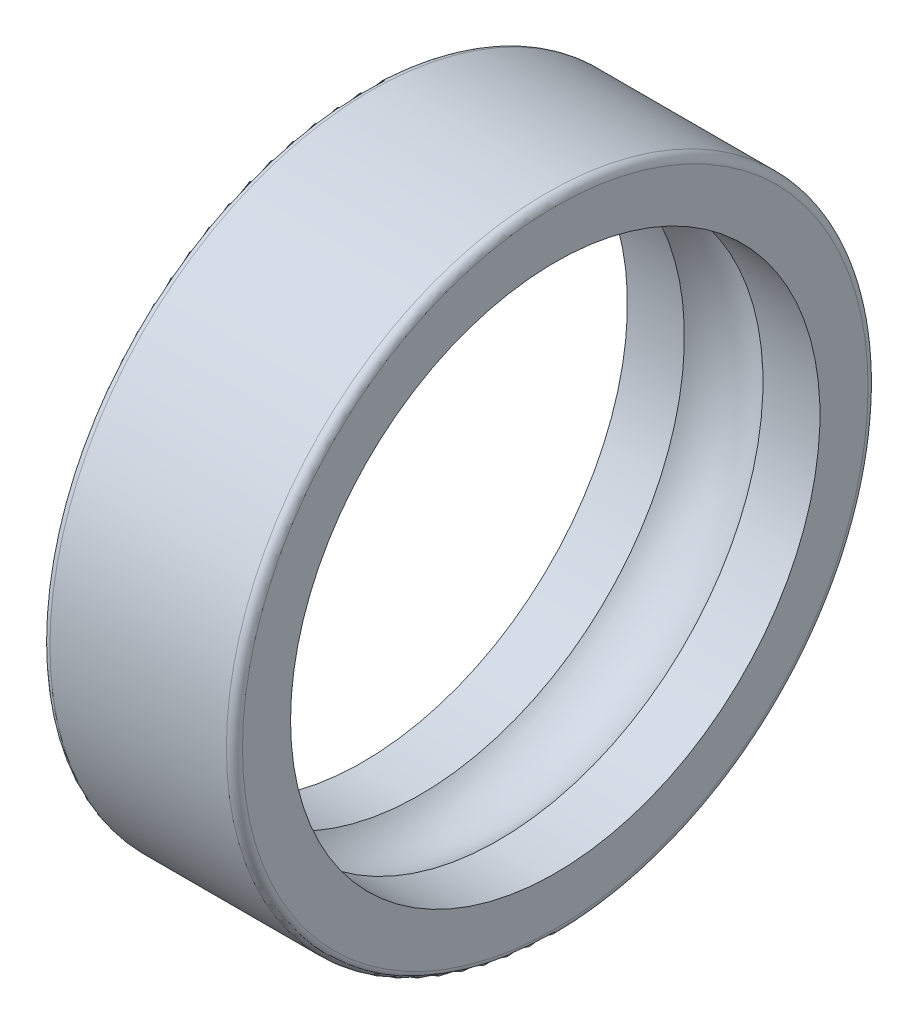
ISO-10303-21;
HEADER;
FILE_DESCRIPTION(('STEP AP214'),'2;1');
FILE_NAME('part.step','',(''),(''),'','','');
FILE_SCHEMA(('AUTOMOTIVE_DESIGN { 1 0 10303 214 1 1 1 1 }'));
ENDSEC;
DATA;
#1=APPLICATION_CONTEXT('core data for automotive mechanical design processes');
#2=APPLICATION_PROTOCOL_DEFINITION('international standard','automotive_design',2000,#1);
#3=PRODUCT_CONTEXT('',#1,'mechanical');
#4=PRODUCT('Part','Part','',(#3));
#5=PRODUCT_RELATED_PRODUCT_CATEGORY('part','',(#4));
#6=PRODUCT_DEFINITION_FORMATION('','',#4);
#7=PRODUCT_DEFINITION_CONTEXT('part definition',#1,'design');
#8=PRODUCT_DEFINITION('design','',#6,#7);
#9=PRODUCT_DEFINITION_SHAPE('','',#8);
#10=(LENGTH_UNIT() NAMED_UNIT(*) SI_UNIT(.MILLI.,.METRE.));
#11=(NAMED_UNIT(*) PLANE_ANGLE_UNIT() SI_UNIT($,.RADIAN.));
#12=(NAMED_UNIT(*) SI_UNIT($,.STERADIAN.) SOLID_ANGLE_UNIT());
#13=UNCERTAINTY_MEASURE_WITH_UNIT(LENGTH_MEASURE(1.E-05),#10,'distance_accuracy_value','');
#14=(GEOMETRIC_REPRESENTATION_CONTEXT(3) GLOBAL_UNCERTAINTY_ASSIGNED_CONTEXT((#13)) GLOBAL_UNIT_ASSIGNED_CONTEXT((#10,
#11,#12)) REPRESENTATION_CONTEXT('',''));
#15=CARTESIAN_POINT('',(0.,0.,0.));
#16=DIRECTION('',(0.,0.,1.));
#17=DIRECTION('',(1.,0.,0.));
#18=AXIS2_PLACEMENT_3D('',#15,#16,#17);
#19=CARTESIAN_POINT('',(-10.537576458291,-14.,0.));
#20=DIRECTION('',(-1.,0.,0.));
#21=DIRECTION('',(0.,0.,1.));
#22=AXIS2_PLACEMENT_3D('',#19,#20,#21);
#23=CYLINDRICAL_SURFACE('',#22,16.5);
#24=CARTESIAN_POINT('',(2.71857748410758,-14.,0.));
#25=DIRECTION('',(-1.,0.,0.));
#26=DIRECTION('',(0.,0.,1.));
#27=AXIS2_PLACEMENT_3D('',#24,#25,#26);
#28=CIRCLE('',#27,16.5);
#29=CARTESIAN_POINT('',(2.71857748410758,-14.,16.5));
#30=VERTEX_POINT('',#29);
#31=EDGE_CURVE('E63',#30,#30,#28,.T.);
#32=ORIENTED_EDGE('',*,*,#31,.F.);
#33=EDGE_LOOP('',(#32));
#34=FACE_BOUND('',#33,.T.);
#35=CARTESIAN_POINT('',(-0.831932773109246,-14.,0.));
#36=DIRECTION('',(-1.,0.,0.));
#37=DIRECTION('',(0.,0.,1.));
#38=AXIS2_PLACEMENT_3D('',#35,#36,#37);
#39=CIRCLE('',#38,16.5);
#40=CARTESIAN_POINT('',(-0.831932773109246,-14.,16.5));
#41=VERTEX_POINT('',#40);
#42=EDGE_CURVE('E10',#41,#41,#39,.T.);
#43=ORIENTED_EDGE('',*,*,#42,.T.);
#44=EDGE_LOOP('',(#43));
#45=FACE_BOUND('',#44,.T.);
#46=ADVANCED_FACE('F35',(#34,#45),#23,.F.);
#47=CARTESIAN_POINT('',(-0.831932773109246,2.5,0.));
#48=DIRECTION('',(1.,0.,0.));
#49=DIRECTION('',(0.,0.,-1.));
#50=AXIS2_PLACEMENT_3D('',#47,#48,#49);
#51=PLANE('',#50);
#52=ORIENTED_EDGE('',*,*,#42,.F.);
#53=EDGE_LOOP('',(#52));
#54=FACE_BOUND('',#53,.T.);
#55=CARTESIAN_POINT('',(-0.831932773109246,-14.,0.));
#56=DIRECTION('',(-1.,0.,0.));
#57=DIRECTION('',(0.,0.,1.));
#58=AXIS2_PLACEMENT_3D('',#55,#56,#57);
#59=CIRCLE('',#58,19.5);
#60=CARTESIAN_POINT('',(-0.831932773109246,-14.,19.5));
#61=VERTEX_POINT('',#60);
#62=EDGE_CURVE('E41',#61,#61,#59,.T.);
#63=ORIENTED_EDGE('',*,*,#62,.T.);
#64=EDGE_LOOP('',(#63));
#65=FACE_BOUND('',#64,.T.);
#66=ADVANCED_FACE('F70',(#54,#65),#51,.F.);
#67=CARTESIAN_POINT('',(-0.331932773109246,-14.,0.));
#68=DIRECTION('',(-1.,0.,0.));
#69=DIRECTION('',(0.,0.,1.));
#70=AXIS2_PLACEMENT_3D('',#67,#68,#69);
#71=TOROIDAL_SURFACE('',#70,19.5,0.5);
#72=ORIENTED_EDGE('',*,*,#62,.F.);
#73=EDGE_LOOP('',(#72));
#74=FACE_BOUND('',#73,.T.);
#75=CARTESIAN_POINT('',(-0.331932773109242,-14.,0.));
#76=DIRECTION('',(-1.,0.,0.));
#77=DIRECTION('',(0.,0.,1.));
#78=AXIS2_PLACEMENT_3D('',#75,#76,#77);
#79=CIRCLE('',#78,20.);
#80=CARTESIAN_POINT('',(-0.331932773109242,-14.,20.));
#81=VERTEX_POINT('',#80);
#82=EDGE_CURVE('E45',#81,#81,#79,.T.);
#83=ORIENTED_EDGE('',*,*,#82,.T.);
#84=EDGE_LOOP('',(#83));
#85=FACE_BOUND('',#84,.T.);
#86=ADVANCED_FACE('F74',(#74,#85),#71,.T.);
#87=CARTESIAN_POINT('',(-10.537576458291,-14.,0.));
#88=DIRECTION('',(-1.,0.,0.));
#89=DIRECTION('',(0.,0.,1.));
#90=AXIS2_PLACEMENT_3D('',#87,#88,#89);
#91=CYLINDRICAL_SURFACE('',#90,20.);
#92=ORIENTED_EDGE('',*,*,#82,.F.);
#93=EDGE_LOOP('',(#92));
#94=FACE_BOUND('',#93,.T.);
#95=CARTESIAN_POINT('',(10.6680672268908,-14.,0.));
#96=DIRECTION('',(-1.,0.,0.));
#97=DIRECTION('',(0.,0.,1.));
#98=AXIS2_PLACEMENT_3D('',#95,#96,#97);
#99=CIRCLE('',#98,20.);
#100=CARTESIAN_POINT('',(10.6680672268908,-14.,20.));
#101=VERTEX_POINT('',#100);
#102=EDGE_CURVE('E49',#101,#101,#99,.T.);
#103=ORIENTED_EDGE('',*,*,#102,.T.);
#104=EDGE_LOOP('',(#103));
#105=FACE_BOUND('',#104,.T.);
#106=ADVANCED_FACE('F79',(#94,#105),#91,.T.);
#107=CARTESIAN_POINT('',(10.6680672268908,-14.,0.));
#108=DIRECTION('',(-1.,0.,0.));
#109=DIRECTION('',(0.,0.,1.));
#110=AXIS2_PLACEMENT_3D('',#107,#108,#109);
#111=TOROIDAL_SURFACE('',#110,19.5,0.5);
#112=ORIENTED_EDGE('',*,*,#102,.F.);
#113=EDGE_LOOP('',(#112));
#114=FACE_BOUND('',#113,.T.);
#115=CARTESIAN_POINT('',(11.1680672268908,-14.,0.));
#116=DIRECTION('',(-1.,0.,0.));
#117=DIRECTION('',(0.,0.,1.));
#118=AXIS2_PLACEMENT_3D('',#115,#116,#117);
#119=CIRCLE('',#118,19.5);
#120=CARTESIAN_POINT('',(11.1680672268908,-14.,19.5));
#121=VERTEX_POINT('',#120);
#122=EDGE_CURVE('E54',#121,#121,#119,.T.);
#123=ORIENTED_EDGE('',*,*,#122,.T.);
#124=EDGE_LOOP('',(#123));
#125=FACE_BOUND('',#124,.T.);
#126=ADVANCED_FACE('F85',(#114,#125),#111,.T.);
#127=CARTESIAN_POINT('',(11.1680672268908,5.5,0.));
#128=DIRECTION('',(-1.,0.,0.));
#129=DIRECTION('',(0.,0.,1.));
#130=AXIS2_PLACEMENT_3D('',#127,#128,#129);
#131=PLANE('',#130);
#132=ORIENTED_EDGE('',*,*,#122,.F.);
#133=EDGE_LOOP('',(#132));
#134=FACE_BOUND('',#133,.T.);
#135=CARTESIAN_POINT('',(11.1680672268908,-14.,0.));
#136=DIRECTION('',(-1.,0.,0.));
#137=DIRECTION('',(0.,0.,1.));
#138=AXIS2_PLACEMENT_3D('',#135,#136,#137);
#139=CIRCLE('',#138,16.5);
#140=CARTESIAN_POINT('',(11.1680672268908,-14.,16.5));
#141=VERTEX_POINT('',#140);
#142=EDGE_CURVE('E57',#141,#141,#139,.T.);
#143=ORIENTED_EDGE('',*,*,#142,.T.);
#144=EDGE_LOOP('',(#143));
#145=FACE_BOUND('',#144,.T.);
#146=ADVANCED_FACE('F89',(#134,#145),#131,.F.);
#147=CARTESIAN_POINT('',(-10.537576458291,-14.,0.));
#148=DIRECTION('',(-1.,0.,0.));
#149=DIRECTION('',(0.,0.,1.));
#150=AXIS2_PLACEMENT_3D('',#147,#148,#149);
#151=CYLINDRICAL_SURFACE('',#150,16.5);
#152=ORIENTED_EDGE('',*,*,#142,.F.);
#153=EDGE_LOOP('',(#152));
#154=FACE_BOUND('',#153,.T.);
#155=CARTESIAN_POINT('',(7.61755696967394,-14.,0.));
#156=DIRECTION('',(-1.,0.,0.));
#157=DIRECTION('',(0.,0.,1.));
#158=AXIS2_PLACEMENT_3D('',#155,#156,#157);
#159=CIRCLE('',#158,16.5);
#160=CARTESIAN_POINT('',(7.61755696967394,-14.,16.5));
#161=VERTEX_POINT('',#160);
#162=EDGE_CURVE('E60',#161,#161,#159,.T.);
#163=ORIENTED_EDGE('',*,*,#162,.T.);
#164=EDGE_LOOP('',(#163));
#165=FACE_BOUND('',#164,.T.);
#166=ADVANCED_FACE('F93',(#154,#165),#151,.F.);
#167=CARTESIAN_POINT('',(5.16806722689076,-14.,0.));
#168=DIRECTION('',(-1.,0.,0.));
#169=DIRECTION('',(0.,0.,1.));
#170=AXIS2_PLACEMENT_3D('',#167,#168,#169);
#171=TOROIDAL_SURFACE('',#170,14.,3.5);
#172=ORIENTED_EDGE('',*,*,#162,.F.);
#173=EDGE_LOOP('',(#172));
#174=FACE_BOUND('',#173,.T.);
#175=ORIENTED_EDGE('',*,*,#31,.T.);
#176=EDGE_LOOP('',(#175));
#177=FACE_BOUND('',#176,.T.);
#178=ADVANCED_FACE('F67',(#174,#177),#171,.F.);
#179=CLOSED_SHELL('',(#46,#66,#86,#106,#126,#146,#166,#178));
#180=MANIFOLD_SOLID_BREP('B2',#179);
#181=ADVANCED_BREP_SHAPE_REPRESENTATION('',(#18,#180),#14);
#182=SHAPE_DEFINITION_REPRESENTATION(#9,#181);
ENDSEC;
END-ISO-10303-21;
